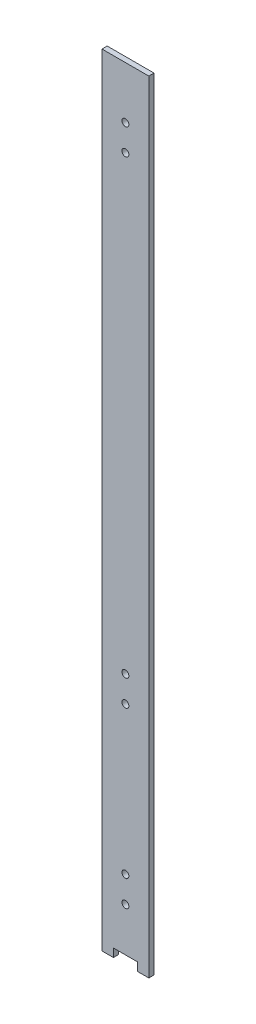
ISO-10303-21;
HEADER;
FILE_DESCRIPTION(('STEP AP214'),'2;1');
FILE_NAME('part.step','',(''),(''),'','','');
FILE_SCHEMA(('AUTOMOTIVE_DESIGN { 1 0 10303 214 1 1 1 1 }'));
ENDSEC;
DATA;
#1=APPLICATION_CONTEXT('core data for automotive mechanical design processes');
#2=APPLICATION_PROTOCOL_DEFINITION('international standard','automotive_design',2000,#1);
#3=PRODUCT_CONTEXT('',#1,'mechanical');
#4=PRODUCT('Part','Part','',(#3));
#5=PRODUCT_RELATED_PRODUCT_CATEGORY('part','',(#4));
#6=PRODUCT_DEFINITION_FORMATION('','',#4);
#7=PRODUCT_DEFINITION_CONTEXT('part definition',#1,'design');
#8=PRODUCT_DEFINITION('design','',#6,#7);
#9=PRODUCT_DEFINITION_SHAPE('','',#8);
#10=(LENGTH_UNIT() NAMED_UNIT(*) SI_UNIT(.MILLI.,.METRE.));
#11=(NAMED_UNIT(*) PLANE_ANGLE_UNIT() SI_UNIT($,.RADIAN.));
#12=(NAMED_UNIT(*) SI_UNIT($,.STERADIAN.) SOLID_ANGLE_UNIT());
#13=UNCERTAINTY_MEASURE_WITH_UNIT(LENGTH_MEASURE(1.E-05),#10,'distance_accuracy_value','');
#14=(GEOMETRIC_REPRESENTATION_CONTEXT(3) GLOBAL_UNCERTAINTY_ASSIGNED_CONTEXT((#13)) GLOBAL_UNIT_ASSIGNED_CONTEXT((#10,
#11,#12)) REPRESENTATION_CONTEXT('',''));
#15=CARTESIAN_POINT('',(0.,0.,0.));
#16=DIRECTION('',(0.,0.,1.));
#17=DIRECTION('',(1.,0.,0.));
#18=AXIS2_PLACEMENT_3D('',#15,#16,#17);
#19=CARTESIAN_POINT('',(0.,0.,0.));
#20=DIRECTION('',(0.,1.,0.));
#21=DIRECTION('',(0.,0.,1.));
#22=AXIS2_PLACEMENT_3D('',#19,#20,#21);
#23=PLANE('',#22);
#24=DIRECTION('',(1.,0.,0.));
#25=VECTOR('',#24,1.);
#26=CARTESIAN_POINT('',(13.5,0.,1.5));
#27=LINE('',#26,#25);
#28=CARTESIAN_POINT('',(6.91531792152884,0.,1.5));
#29=VERTEX_POINT('',#28);
#30=CARTESIAN_POINT('',(13.5,0.,1.5));
#31=VERTEX_POINT('',#30);
#32=EDGE_CURVE('E146',#29,#31,#27,.T.);
#33=ORIENTED_EDGE('',*,*,#32,.F.);
#34=DIRECTION('',(0.,0.,-1.));
#35=VECTOR('',#34,1.);
#36=CARTESIAN_POINT('',(6.91531792152884,0.,0.));
#37=LINE('',#36,#35);
#38=CARTESIAN_POINT('',(6.91531792152884,0.,-1.5));
#39=VERTEX_POINT('',#38);
#40=EDGE_CURVE('E11',#29,#39,#37,.T.);
#41=ORIENTED_EDGE('',*,*,#40,.T.);
#42=DIRECTION('',(-1.,0.,0.));
#43=VECTOR('',#42,1.);
#44=CARTESIAN_POINT('',(13.5,0.,-1.5));
#45=LINE('',#44,#43);
#46=CARTESIAN_POINT('',(13.5,0.,-1.5));
#47=VERTEX_POINT('',#46);
#48=EDGE_CURVE('E138',#47,#39,#45,.T.);
#49=ORIENTED_EDGE('',*,*,#48,.F.);
#50=DIRECTION('',(0.,0.,-1.));
#51=VECTOR('',#50,1.);
#52=CARTESIAN_POINT('',(13.5,0.,1.5));
#53=LINE('',#52,#51);
#54=EDGE_CURVE('E148',#31,#47,#53,.T.);
#55=ORIENTED_EDGE('',*,*,#54,.F.);
#56=EDGE_LOOP('',(#33,#41,#49,#55));
#57=FACE_BOUND('',#56,.T.);
#58=ADVANCED_FACE('F32',(#57),#23,.F.);
#59=CARTESIAN_POINT('',(-13.5,450.,1.5));
#60=DIRECTION('',(1.,0.,0.));
#61=DIRECTION('',(0.,0.,-1.));
#62=AXIS2_PLACEMENT_3D('',#59,#60,#61);
#63=PLANE('',#62);
#64=DIRECTION('',(0.,0.,1.));
#65=VECTOR('',#64,1.);
#66=CARTESIAN_POINT('',(-13.5,0.,1.5));
#67=LINE('',#66,#65);
#68=CARTESIAN_POINT('',(-13.5,0.,-1.5));
#69=VERTEX_POINT('',#68);
#70=CARTESIAN_POINT('',(-13.5,0.,1.5));
#71=VERTEX_POINT('',#70);
#72=EDGE_CURVE('E134',#69,#71,#67,.T.);
#73=ORIENTED_EDGE('',*,*,#72,.T.);
#74=DIRECTION('',(0.,-1.,0.));
#75=VECTOR('',#74,1.);
#76=CARTESIAN_POINT('',(-13.5,450.,1.5));
#77=LINE('',#76,#75);
#78=CARTESIAN_POINT('',(-13.5,450.,1.5));
#79=VERTEX_POINT('',#78);
#80=EDGE_CURVE('E159',#79,#71,#77,.T.);
#81=ORIENTED_EDGE('',*,*,#80,.F.);
#82=DIRECTION('',(0.,0.,1.));
#83=VECTOR('',#82,1.);
#84=CARTESIAN_POINT('',(-13.5,450.,1.5));
#85=LINE('',#84,#83);
#86=CARTESIAN_POINT('',(-13.5,450.,-1.5));
#87=VERTEX_POINT('',#86);
#88=EDGE_CURVE('E136',#87,#79,#85,.T.);
#89=ORIENTED_EDGE('',*,*,#88,.F.);
#90=DIRECTION('',(0.,-1.,0.));
#91=VECTOR('',#90,1.);
#92=CARTESIAN_POINT('',(-13.5,450.,-1.5));
#93=LINE('',#92,#91);
#94=EDGE_CURVE('E143',#87,#69,#93,.T.);
#95=ORIENTED_EDGE('',*,*,#94,.T.);
#96=EDGE_LOOP('',(#73,#81,#89,#95));
#97=FACE_BOUND('',#96,.T.);
#98=ADVANCED_FACE('F34',(#97),#63,.F.);
#99=CARTESIAN_POINT('',(13.5,450.,1.5));
#100=DIRECTION('',(0.,0.,-1.));
#101=DIRECTION('',(-1.,0.,0.));
#102=AXIS2_PLACEMENT_3D('',#99,#100,#101);
#103=PLANE('',#102);
#104=CARTESIAN_POINT('',(0.,145.,1.50000000000001));
#105=DIRECTION('',(0.,0.,-1.));
#106=DIRECTION('',(-1.,0.,0.));
#107=AXIS2_PLACEMENT_3D('',#104,#105,#106);
#108=CIRCLE('',#107,2.);
#109=CARTESIAN_POINT('',(-2.,145.,1.50000000000001));
#110=VERTEX_POINT('',#109);
#111=EDGE_CURVE('E248',#110,#110,#108,.T.);
#112=ORIENTED_EDGE('',*,*,#111,.T.);
#113=EDGE_LOOP('',(#112));
#114=FACE_BOUND('',#113,.T.);
#115=CARTESIAN_POINT('',(0.,130.,1.50000000000001));
#116=DIRECTION('',(0.,0.,-1.));
#117=DIRECTION('',(-1.,0.,0.));
#118=AXIS2_PLACEMENT_3D('',#115,#116,#117);
#119=CIRCLE('',#118,2.);
#120=CARTESIAN_POINT('',(-2.,130.,1.50000000000001));
#121=VERTEX_POINT('',#120);
#122=EDGE_CURVE('E238',#121,#121,#119,.T.);
#123=ORIENTED_EDGE('',*,*,#122,.T.);
#124=EDGE_LOOP('',(#123));
#125=FACE_BOUND('',#124,.T.);
#126=CARTESIAN_POINT('',(0.,45.,1.50000000000001));
#127=DIRECTION('',(0.,0.,-1.));
#128=DIRECTION('',(-1.,0.,0.));
#129=AXIS2_PLACEMENT_3D('',#126,#127,#128);
#130=CIRCLE('',#129,2.);
#131=CARTESIAN_POINT('',(-2.,45.,1.50000000000001));
#132=VERTEX_POINT('',#131);
#133=EDGE_CURVE('E233',#132,#132,#130,.T.);
#134=ORIENTED_EDGE('',*,*,#133,.T.);
#135=EDGE_LOOP('',(#134));
#136=FACE_BOUND('',#135,.T.);
#137=CARTESIAN_POINT('',(0.,30.,1.50000000000001));
#138=DIRECTION('',(0.,0.,-1.));
#139=DIRECTION('',(-1.,0.,0.));
#140=AXIS2_PLACEMENT_3D('',#137,#138,#139);
#141=CIRCLE('',#140,2.);
#142=CARTESIAN_POINT('',(-2.,30.,1.50000000000001));
#143=VERTEX_POINT('',#142);
#144=EDGE_CURVE('E261',#143,#143,#141,.T.);
#145=ORIENTED_EDGE('',*,*,#144,.T.);
#146=EDGE_LOOP('',(#145));
#147=FACE_BOUND('',#146,.T.);
#148=CARTESIAN_POINT('',(0.,405.,1.50000000000001));
#149=DIRECTION('',(0.,0.,-1.));
#150=DIRECTION('',(-1.,0.,0.));
#151=AXIS2_PLACEMENT_3D('',#148,#149,#150);
#152=CIRCLE('',#151,2.00000000000002);
#153=CARTESIAN_POINT('',(-2.00000000000002,405.,1.50000000000001));
#154=VERTEX_POINT('',#153);
#155=EDGE_CURVE('E254',#154,#154,#152,.T.);
#156=ORIENTED_EDGE('',*,*,#155,.T.);
#157=EDGE_LOOP('',(#156));
#158=FACE_BOUND('',#157,.T.);
#159=CARTESIAN_POINT('',(0.,420.,1.50000000000001));
#160=DIRECTION('',(0.,0.,-1.));
#161=DIRECTION('',(-1.,0.,0.));
#162=AXIS2_PLACEMENT_3D('',#159,#160,#161);
#163=CIRCLE('',#162,1.99999999999999);
#164=CARTESIAN_POINT('',(-1.99999999999999,420.,1.50000000000001));
#165=VERTEX_POINT('',#164);
#166=EDGE_CURVE('E131',#165,#165,#163,.T.);
#167=ORIENTED_EDGE('',*,*,#166,.T.);
#168=EDGE_LOOP('',(#167));
#169=FACE_BOUND('',#168,.T.);
#170=DIRECTION('',(1.,0.,0.));
#171=VECTOR('',#170,1.);
#172=CARTESIAN_POINT('',(-6.91531792152884,4.77912167963543,1.5));
#173=LINE('',#172,#171);
#174=CARTESIAN_POINT('',(-6.91531792152884,4.77912167963543,1.5));
#175=VERTEX_POINT('',#174);
#176=CARTESIAN_POINT('',(6.91531792152884,4.77912167963543,1.5));
#177=VERTEX_POINT('',#176);
#178=EDGE_CURVE('E113',#175,#177,#173,.T.);
#179=ORIENTED_EDGE('',*,*,#178,.T.);
#180=DIRECTION('',(0.,-1.,0.));
#181=VECTOR('',#180,1.);
#182=CARTESIAN_POINT('',(6.91531792152884,-4.77912167963543,1.5));
#183=LINE('',#182,#181);
#184=EDGE_CURVE('E123',#177,#29,#183,.T.);
#185=ORIENTED_EDGE('',*,*,#184,.T.);
#186=ORIENTED_EDGE('',*,*,#32,.T.);
#187=DIRECTION('',(0.,-1.,0.));
#188=VECTOR('',#187,1.);
#189=CARTESIAN_POINT('',(13.5,450.,1.5));
#190=LINE('',#189,#188);
#191=CARTESIAN_POINT('',(13.5,450.,1.5));
#192=VERTEX_POINT('',#191);
#193=EDGE_CURVE('E156',#192,#31,#190,.T.);
#194=ORIENTED_EDGE('',*,*,#193,.F.);
#195=DIRECTION('',(1.,0.,0.));
#196=VECTOR('',#195,1.);
#197=CARTESIAN_POINT('',(13.5,450.,1.5));
#198=LINE('',#197,#196);
#199=EDGE_CURVE('E85',#79,#192,#198,.T.);
#200=ORIENTED_EDGE('',*,*,#199,.F.);
#201=ORIENTED_EDGE('',*,*,#80,.T.);
#202=CARTESIAN_POINT('',(-6.91531792152884,0.,1.5));
#203=VERTEX_POINT('',#202);
#204=EDGE_CURVE('E122',#71,#203,#27,.T.);
#205=ORIENTED_EDGE('',*,*,#204,.T.);
#206=DIRECTION('',(0.,1.,0.));
#207=VECTOR('',#206,1.);
#208=CARTESIAN_POINT('',(-6.91531792152884,-4.77912167963543,1.5));
#209=LINE('',#208,#207);
#210=EDGE_CURVE('E47',#203,#175,#209,.T.);
#211=ORIENTED_EDGE('',*,*,#210,.T.);
#212=EDGE_LOOP('',(#179,#185,#186,#194,#200,#201,#205,#211));
#213=FACE_BOUND('',#212,.T.);
#214=ADVANCED_FACE('F121',(#114,#125,#136,#147,#158,#169,#213),#103,.F.);
#215=CARTESIAN_POINT('',(13.5,450.,1.5));
#216=DIRECTION('',(-1.,0.,0.));
#217=DIRECTION('',(0.,0.,1.));
#218=AXIS2_PLACEMENT_3D('',#215,#216,#217);
#219=PLANE('',#218);
#220=ORIENTED_EDGE('',*,*,#54,.T.);
#221=DIRECTION('',(0.,-1.,0.));
#222=VECTOR('',#221,1.);
#223=CARTESIAN_POINT('',(13.5,450.,-1.5));
#224=LINE('',#223,#222);
#225=CARTESIAN_POINT('',(13.5,450.,-1.5));
#226=VERTEX_POINT('',#225);
#227=EDGE_CURVE('E153',#226,#47,#224,.T.);
#228=ORIENTED_EDGE('',*,*,#227,.F.);
#229=DIRECTION('',(0.,0.,-1.));
#230=VECTOR('',#229,1.);
#231=CARTESIAN_POINT('',(13.5,450.,1.5));
#232=LINE('',#231,#230);
#233=EDGE_CURVE('E140',#192,#226,#232,.T.);
#234=ORIENTED_EDGE('',*,*,#233,.F.);
#235=ORIENTED_EDGE('',*,*,#193,.T.);
#236=EDGE_LOOP('',(#220,#228,#234,#235));
#237=FACE_BOUND('',#236,.T.);
#238=ADVANCED_FACE('F173',(#237),#219,.F.);
#239=CARTESIAN_POINT('',(13.5,450.,-1.5));
#240=DIRECTION('',(0.,0.,1.));
#241=DIRECTION('',(1.,0.,0.));
#242=AXIS2_PLACEMENT_3D('',#239,#240,#241);
#243=PLANE('',#242);
#244=CARTESIAN_POINT('',(0.,145.,-1.5));
#245=DIRECTION('',(0.,0.,-1.));
#246=DIRECTION('',(-1.,0.,0.));
#247=AXIS2_PLACEMENT_3D('',#244,#245,#246);
#248=CIRCLE('',#247,2.);
#249=CARTESIAN_POINT('',(-2.,145.,-1.5));
#250=VERTEX_POINT('',#249);
#251=EDGE_CURVE('E251',#250,#250,#248,.T.);
#252=ORIENTED_EDGE('',*,*,#251,.F.);
#253=EDGE_LOOP('',(#252));
#254=FACE_BOUND('',#253,.T.);
#255=CARTESIAN_POINT('',(0.,130.,-1.5));
#256=DIRECTION('',(0.,0.,-1.));
#257=DIRECTION('',(-1.,0.,0.));
#258=AXIS2_PLACEMENT_3D('',#255,#256,#257);
#259=CIRCLE('',#258,2.);
#260=CARTESIAN_POINT('',(-2.,130.,-1.5));
#261=VERTEX_POINT('',#260);
#262=EDGE_CURVE('E243',#261,#261,#259,.T.);
#263=ORIENTED_EDGE('',*,*,#262,.F.);
#264=EDGE_LOOP('',(#263));
#265=FACE_BOUND('',#264,.T.);
#266=CARTESIAN_POINT('',(0.,45.,-1.5));
#267=DIRECTION('',(0.,0.,-1.));
#268=DIRECTION('',(-1.,0.,0.));
#269=AXIS2_PLACEMENT_3D('',#266,#267,#268);
#270=CIRCLE('',#269,2.);
#271=CARTESIAN_POINT('',(-2.,45.,-1.5));
#272=VERTEX_POINT('',#271);
#273=EDGE_CURVE('E236',#272,#272,#270,.T.);
#274=ORIENTED_EDGE('',*,*,#273,.F.);
#275=EDGE_LOOP('',(#274));
#276=FACE_BOUND('',#275,.T.);
#277=CARTESIAN_POINT('',(0.,30.,-1.5));
#278=DIRECTION('',(0.,0.,-1.));
#279=DIRECTION('',(-1.,0.,0.));
#280=AXIS2_PLACEMENT_3D('',#277,#278,#279);
#281=CIRCLE('',#280,2.);
#282=CARTESIAN_POINT('',(-2.,30.,-1.5));
#283=VERTEX_POINT('',#282);
#284=EDGE_CURVE('E240',#283,#283,#281,.T.);
#285=ORIENTED_EDGE('',*,*,#284,.F.);
#286=EDGE_LOOP('',(#285));
#287=FACE_BOUND('',#286,.T.);
#288=CARTESIAN_POINT('',(0.,405.,-1.5));
#289=DIRECTION('',(0.,0.,-1.));
#290=DIRECTION('',(-1.,0.,0.));
#291=AXIS2_PLACEMENT_3D('',#288,#289,#290);
#292=CIRCLE('',#291,2.00000000000002);
#293=CARTESIAN_POINT('',(-2.00000000000002,405.,-1.5));
#294=VERTEX_POINT('',#293);
#295=EDGE_CURVE('E258',#294,#294,#292,.T.);
#296=ORIENTED_EDGE('',*,*,#295,.F.);
#297=EDGE_LOOP('',(#296));
#298=FACE_BOUND('',#297,.T.);
#299=CARTESIAN_POINT('',(0.,420.,-1.5));
#300=DIRECTION('',(0.,0.,-1.));
#301=DIRECTION('',(-1.,0.,0.));
#302=AXIS2_PLACEMENT_3D('',#299,#300,#301);
#303=CIRCLE('',#302,1.99999999999999);
#304=CARTESIAN_POINT('',(-1.99999999999999,420.,-1.5));
#305=VERTEX_POINT('',#304);
#306=EDGE_CURVE('E257',#305,#305,#303,.T.);
#307=ORIENTED_EDGE('',*,*,#306,.F.);
#308=EDGE_LOOP('',(#307));
#309=FACE_BOUND('',#308,.T.);
#310=ORIENTED_EDGE('',*,*,#48,.T.);
#311=DIRECTION('',(0.,-1.,0.));
#312=VECTOR('',#311,1.);
#313=CARTESIAN_POINT('',(6.91531792152884,-4.77912167963543,-1.5));
#314=LINE('',#313,#312);
#315=CARTESIAN_POINT('',(6.91531792152884,4.77912167963543,-1.5));
#316=VERTEX_POINT('',#315);
#317=EDGE_CURVE('E129',#316,#39,#314,.T.);
#318=ORIENTED_EDGE('',*,*,#317,.F.);
#319=DIRECTION('',(1.,0.,0.));
#320=VECTOR('',#319,1.);
#321=CARTESIAN_POINT('',(-6.91531792152884,4.77912167963543,-1.5));
#322=LINE('',#321,#320);
#323=CARTESIAN_POINT('',(-6.91531792152884,4.77912167963543,-1.5));
#324=VERTEX_POINT('',#323);
#325=EDGE_CURVE('E125',#324,#316,#322,.T.);
#326=ORIENTED_EDGE('',*,*,#325,.F.);
#327=DIRECTION('',(0.,1.,0.));
#328=VECTOR('',#327,1.);
#329=CARTESIAN_POINT('',(-6.91531792152884,-4.77912167963543,-1.5));
#330=LINE('',#329,#328);
#331=CARTESIAN_POINT('',(-6.91531792152884,0.,-1.5));
#332=VERTEX_POINT('',#331);
#333=EDGE_CURVE('E108',#332,#324,#330,.T.);
#334=ORIENTED_EDGE('',*,*,#333,.F.);
#335=EDGE_CURVE('E77',#332,#69,#45,.T.);
#336=ORIENTED_EDGE('',*,*,#335,.T.);
#337=ORIENTED_EDGE('',*,*,#94,.F.);
#338=DIRECTION('',(-1.,0.,0.));
#339=VECTOR('',#338,1.);
#340=CARTESIAN_POINT('',(13.5,450.,-1.5));
#341=LINE('',#340,#339);
#342=EDGE_CURVE('E56',#226,#87,#341,.T.);
#343=ORIENTED_EDGE('',*,*,#342,.F.);
#344=ORIENTED_EDGE('',*,*,#227,.T.);
#345=EDGE_LOOP('',(#310,#318,#326,#334,#336,#337,#343,#344));
#346=FACE_BOUND('',#345,.T.);
#347=ADVANCED_FACE('F163',(#254,#265,#276,#287,#298,#309,#346),#243,.F.);
#348=CARTESIAN_POINT('',(0.,450.,0.));
#349=DIRECTION('',(0.,1.,0.));
#350=DIRECTION('',(0.,0.,1.));
#351=AXIS2_PLACEMENT_3D('',#348,#349,#350);
#352=PLANE('',#351);
#353=ORIENTED_EDGE('',*,*,#88,.T.);
#354=ORIENTED_EDGE('',*,*,#199,.T.);
#355=ORIENTED_EDGE('',*,*,#233,.T.);
#356=ORIENTED_EDGE('',*,*,#342,.T.);
#357=EDGE_LOOP('',(#353,#354,#355,#356));
#358=FACE_BOUND('',#357,.T.);
#359=ADVANCED_FACE('F175',(#358),#352,.T.);
#360=ORIENTED_EDGE('',*,*,#335,.F.);
#361=DIRECTION('',(0.,0.,1.));
#362=VECTOR('',#361,1.);
#363=CARTESIAN_POINT('',(-6.91531792152884,0.,0.));
#364=LINE('',#363,#362);
#365=EDGE_CURVE('E40',#332,#203,#364,.T.);
#366=ORIENTED_EDGE('',*,*,#365,.T.);
#367=ORIENTED_EDGE('',*,*,#204,.F.);
#368=ORIENTED_EDGE('',*,*,#72,.F.);
#369=EDGE_LOOP('',(#360,#366,#367,#368));
#370=FACE_BOUND('',#369,.T.);
#371=ADVANCED_FACE('F161',(#370),#23,.F.);
#372=CARTESIAN_POINT('',(6.91531792152884,-4.77912167963543,1.5));
#373=DIRECTION('',(1.,0.,0.));
#374=DIRECTION('',(0.,0.,-1.));
#375=AXIS2_PLACEMENT_3D('',#372,#373,#374);
#376=PLANE('',#375);
#377=ORIENTED_EDGE('',*,*,#184,.F.);
#378=DIRECTION('',(0.,0.,-1.));
#379=VECTOR('',#378,1.);
#380=CARTESIAN_POINT('',(6.91531792152884,4.77912167963543,1.5));
#381=LINE('',#380,#379);
#382=EDGE_CURVE('E112',#177,#316,#381,.T.);
#383=ORIENTED_EDGE('',*,*,#382,.T.);
#384=ORIENTED_EDGE('',*,*,#317,.T.);
#385=ORIENTED_EDGE('',*,*,#40,.F.);
#386=EDGE_LOOP('',(#377,#383,#384,#385));
#387=FACE_BOUND('',#386,.T.);
#388=ADVANCED_FACE('F167',(#387),#376,.F.);
#389=CARTESIAN_POINT('',(-6.91531792152884,-4.77912167963543,1.5));
#390=DIRECTION('',(-1.,0.,0.));
#391=DIRECTION('',(0.,0.,1.));
#392=AXIS2_PLACEMENT_3D('',#389,#390,#391);
#393=PLANE('',#392);
#394=ORIENTED_EDGE('',*,*,#333,.T.);
#395=DIRECTION('',(0.,0.,-1.));
#396=VECTOR('',#395,1.);
#397=CARTESIAN_POINT('',(-6.91531792152884,4.77912167963543,1.5));
#398=LINE('',#397,#396);
#399=EDGE_CURVE('E105',#175,#324,#398,.T.);
#400=ORIENTED_EDGE('',*,*,#399,.F.);
#401=ORIENTED_EDGE('',*,*,#210,.F.);
#402=ORIENTED_EDGE('',*,*,#365,.F.);
#403=EDGE_LOOP('',(#394,#400,#401,#402));
#404=FACE_BOUND('',#403,.T.);
#405=ADVANCED_FACE('F107',(#404),#393,.F.);
#406=CARTESIAN_POINT('',(-6.91531792152884,4.77912167963543,1.5));
#407=DIRECTION('',(0.,1.,0.));
#408=DIRECTION('',(0.,0.,1.));
#409=AXIS2_PLACEMENT_3D('',#406,#407,#408);
#410=PLANE('',#409);
#411=ORIENTED_EDGE('',*,*,#325,.T.);
#412=ORIENTED_EDGE('',*,*,#382,.F.);
#413=ORIENTED_EDGE('',*,*,#178,.F.);
#414=ORIENTED_EDGE('',*,*,#399,.T.);
#415=EDGE_LOOP('',(#411,#412,#413,#414));
#416=FACE_BOUND('',#415,.T.);
#417=ADVANCED_FACE('F116',(#416),#410,.F.);
#418=CARTESIAN_POINT('',(0.,420.,1.50000000000001));
#419=DIRECTION('',(0.,0.,-1.));
#420=DIRECTION('',(-1.,0.,0.));
#421=AXIS2_PLACEMENT_3D('',#418,#419,#420);
#422=CYLINDRICAL_SURFACE('',#421,1.99999999999999);
#423=ORIENTED_EDGE('',*,*,#166,.F.);
#424=EDGE_LOOP('',(#423));
#425=FACE_BOUND('',#424,.T.);
#426=ORIENTED_EDGE('',*,*,#306,.T.);
#427=EDGE_LOOP('',(#426));
#428=FACE_BOUND('',#427,.T.);
#429=ADVANCED_FACE('F205',(#425,#428),#422,.F.);
#430=CARTESIAN_POINT('',(0.,405.,1.50000000000001));
#431=DIRECTION('',(0.,0.,-1.));
#432=DIRECTION('',(-1.,0.,0.));
#433=AXIS2_PLACEMENT_3D('',#430,#431,#432);
#434=CYLINDRICAL_SURFACE('',#433,2.00000000000002);
#435=ORIENTED_EDGE('',*,*,#155,.F.);
#436=EDGE_LOOP('',(#435));
#437=FACE_BOUND('',#436,.T.);
#438=ORIENTED_EDGE('',*,*,#295,.T.);
#439=EDGE_LOOP('',(#438));
#440=FACE_BOUND('',#439,.T.);
#441=ADVANCED_FACE('F208',(#437,#440),#434,.F.);
#442=CARTESIAN_POINT('',(0.,30.,1.50000000000001));
#443=DIRECTION('',(0.,0.,-1.));
#444=DIRECTION('',(-1.,0.,0.));
#445=AXIS2_PLACEMENT_3D('',#442,#443,#444);
#446=CYLINDRICAL_SURFACE('',#445,2.);
#447=ORIENTED_EDGE('',*,*,#144,.F.);
#448=EDGE_LOOP('',(#447));
#449=FACE_BOUND('',#448,.T.);
#450=ORIENTED_EDGE('',*,*,#284,.T.);
#451=EDGE_LOOP('',(#450));
#452=FACE_BOUND('',#451,.T.);
#453=ADVANCED_FACE('F210',(#449,#452),#446,.F.);
#454=CARTESIAN_POINT('',(0.,45.,1.50000000000001));
#455=DIRECTION('',(0.,0.,-1.));
#456=DIRECTION('',(-1.,0.,0.));
#457=AXIS2_PLACEMENT_3D('',#454,#455,#456);
#458=CYLINDRICAL_SURFACE('',#457,2.);
#459=ORIENTED_EDGE('',*,*,#133,.F.);
#460=EDGE_LOOP('',(#459));
#461=FACE_BOUND('',#460,.T.);
#462=ORIENTED_EDGE('',*,*,#273,.T.);
#463=EDGE_LOOP('',(#462));
#464=FACE_BOUND('',#463,.T.);
#465=ADVANCED_FACE('F213',(#461,#464),#458,.F.);
#466=CARTESIAN_POINT('',(0.,130.,1.50000000000001));
#467=DIRECTION('',(0.,0.,-1.));
#468=DIRECTION('',(-1.,0.,0.));
#469=AXIS2_PLACEMENT_3D('',#466,#467,#468);
#470=CYLINDRICAL_SURFACE('',#469,2.);
#471=ORIENTED_EDGE('',*,*,#122,.F.);
#472=EDGE_LOOP('',(#471));
#473=FACE_BOUND('',#472,.T.);
#474=ORIENTED_EDGE('',*,*,#262,.T.);
#475=EDGE_LOOP('',(#474));
#476=FACE_BOUND('',#475,.T.);
#477=ADVANCED_FACE('F221',(#473,#476),#470,.F.);
#478=CARTESIAN_POINT('',(0.,145.,1.50000000000001));
#479=DIRECTION('',(0.,0.,-1.));
#480=DIRECTION('',(-1.,0.,0.));
#481=AXIS2_PLACEMENT_3D('',#478,#479,#480);
#482=CYLINDRICAL_SURFACE('',#481,2.);
#483=ORIENTED_EDGE('',*,*,#111,.F.);
#484=EDGE_LOOP('',(#483));
#485=FACE_BOUND('',#484,.T.);
#486=ORIENTED_EDGE('',*,*,#251,.T.);
#487=EDGE_LOOP('',(#486));
#488=FACE_BOUND('',#487,.T.);
#489=ADVANCED_FACE('F218',(#485,#488),#482,.F.);
#490=CLOSED_SHELL('',(#58,#98,#214,#238,#347,#359,#371,#388,#405,#417,#429,#441,#453,#465,#477,#489));
#491=MANIFOLD_SOLID_BREP('B2',#490);
#492=ADVANCED_BREP_SHAPE_REPRESENTATION('',(#18,#491),#14);
#493=SHAPE_DEFINITION_REPRESENTATION(#9,#492);
ENDSEC;
END-ISO-10303-21;
